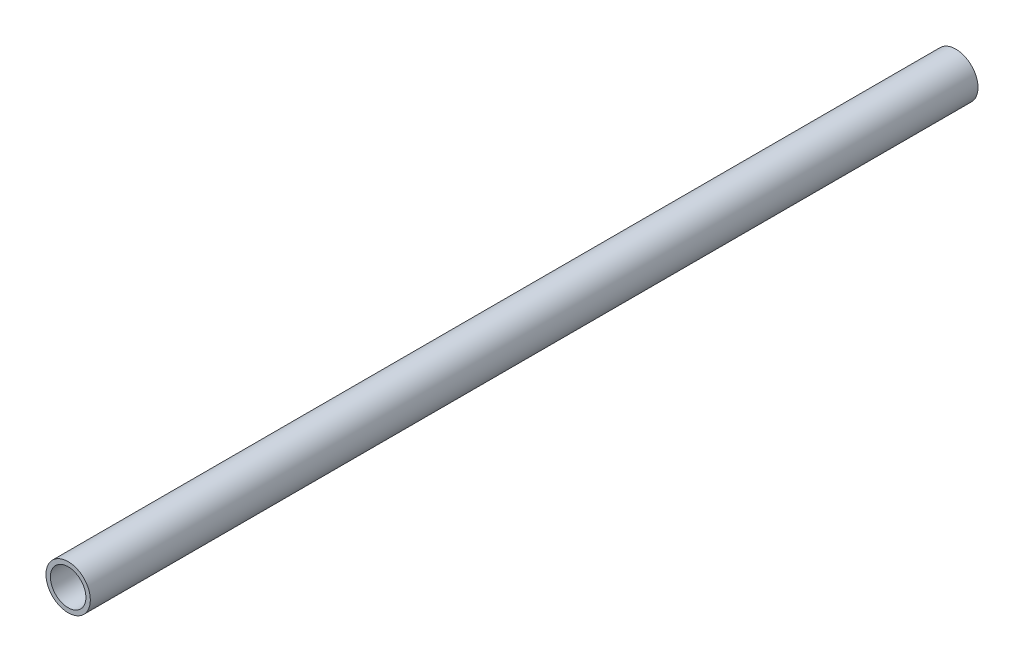
ISO-10303-21;
HEADER;
FILE_DESCRIPTION(('STEP AP214'),'2;1');
FILE_NAME('part.step','',(''),(''),'','','');
FILE_SCHEMA(('AUTOMOTIVE_DESIGN { 1 0 10303 214 1 1 1 1 }'));
ENDSEC;
DATA;
#1=APPLICATION_CONTEXT('core data for automotive mechanical design processes');
#2=APPLICATION_PROTOCOL_DEFINITION('international standard','automotive_design',2000,#1);
#3=PRODUCT_CONTEXT('',#1,'mechanical');
#4=PRODUCT('Part','Part','',(#3));
#5=PRODUCT_RELATED_PRODUCT_CATEGORY('part','',(#4));
#6=PRODUCT_DEFINITION_FORMATION('','',#4);
#7=PRODUCT_DEFINITION_CONTEXT('part definition',#1,'design');
#8=PRODUCT_DEFINITION('design','',#6,#7);
#9=PRODUCT_DEFINITION_SHAPE('','',#8);
#10=(LENGTH_UNIT() NAMED_UNIT(*) SI_UNIT(.MILLI.,.METRE.));
#11=(NAMED_UNIT(*) PLANE_ANGLE_UNIT() SI_UNIT($,.RADIAN.));
#12=(NAMED_UNIT(*) SI_UNIT($,.STERADIAN.) SOLID_ANGLE_UNIT());
#13=UNCERTAINTY_MEASURE_WITH_UNIT(LENGTH_MEASURE(1.E-05),#10,'distance_accuracy_value','');
#14=(GEOMETRIC_REPRESENTATION_CONTEXT(3) GLOBAL_UNCERTAINTY_ASSIGNED_CONTEXT((#13)) GLOBAL_UNIT_ASSIGNED_CONTEXT((#10,
#11,#12)) REPRESENTATION_CONTEXT('',''));
#15=CARTESIAN_POINT('',(0.,0.,0.));
#16=DIRECTION('',(0.,0.,1.));
#17=DIRECTION('',(1.,0.,0.));
#18=AXIS2_PLACEMENT_3D('',#15,#16,#17);
#19=CARTESIAN_POINT('',(0.,0.,200.));
#20=DIRECTION('',(0.,0.,1.));
#21=DIRECTION('',(1.,0.,0.));
#22=AXIS2_PLACEMENT_3D('',#19,#20,#21);
#23=PLANE('',#22);
#24=CARTESIAN_POINT('',(0.,0.,200.));
#25=DIRECTION('',(0.,0.,1.));
#26=DIRECTION('',(1.,0.,0.));
#27=AXIS2_PLACEMENT_3D('',#24,#25,#26);
#28=CIRCLE('',#27,5.);
#29=CARTESIAN_POINT('',(5.,0.,200.));
#30=VERTEX_POINT('',#29);
#31=EDGE_CURVE('E10',#30,#30,#28,.T.);
#32=ORIENTED_EDGE('',*,*,#31,.T.);
#33=EDGE_LOOP('',(#32));
#34=FACE_BOUND('',#33,.T.);
#35=CARTESIAN_POINT('',(0.,0.,200.));
#36=DIRECTION('',(0.,0.,1.));
#37=DIRECTION('',(1.,0.,0.));
#38=AXIS2_PLACEMENT_3D('',#35,#36,#37);
#39=CIRCLE('',#38,4.);
#40=CARTESIAN_POINT('',(4.,0.,200.));
#41=VERTEX_POINT('',#40);
#42=EDGE_CURVE('E42',#41,#41,#39,.T.);
#43=ORIENTED_EDGE('',*,*,#42,.F.);
#44=EDGE_LOOP('',(#43));
#45=FACE_BOUND('',#44,.T.);
#46=ADVANCED_FACE('F31',(#34,#45),#23,.T.);
#47=CARTESIAN_POINT('',(0.,0.,0.));
#48=DIRECTION('',(0.,0.,1.));
#49=DIRECTION('',(1.,0.,0.));
#50=AXIS2_PLACEMENT_3D('',#47,#48,#49);
#51=PLANE('',#50);
#52=CARTESIAN_POINT('',(0.,0.,0.));
#53=DIRECTION('',(0.,0.,1.));
#54=DIRECTION('',(1.,0.,0.));
#55=AXIS2_PLACEMENT_3D('',#52,#53,#54);
#56=CIRCLE('',#55,5.);
#57=CARTESIAN_POINT('',(5.,0.,0.));
#58=VERTEX_POINT('',#57);
#59=EDGE_CURVE('E35',#58,#58,#56,.T.);
#60=ORIENTED_EDGE('',*,*,#59,.F.);
#61=EDGE_LOOP('',(#60));
#62=FACE_BOUND('',#61,.T.);
#63=CARTESIAN_POINT('',(0.,0.,0.));
#64=DIRECTION('',(0.,0.,1.));
#65=DIRECTION('',(1.,0.,0.));
#66=AXIS2_PLACEMENT_3D('',#63,#64,#65);
#67=CIRCLE('',#66,4.);
#68=CARTESIAN_POINT('',(4.,0.,0.));
#69=VERTEX_POINT('',#68);
#70=EDGE_CURVE('E44',#69,#69,#67,.T.);
#71=ORIENTED_EDGE('',*,*,#70,.T.);
#72=EDGE_LOOP('',(#71));
#73=FACE_BOUND('',#72,.T.);
#74=ADVANCED_FACE('F54',(#62,#73),#51,.F.);
#75=CARTESIAN_POINT('',(0.,0.,200.));
#76=DIRECTION('',(0.,0.,-1.));
#77=DIRECTION('',(-1.,0.,0.));
#78=AXIS2_PLACEMENT_3D('',#75,#76,#77);
#79=CYLINDRICAL_SURFACE('',#78,5.);
#80=ORIENTED_EDGE('',*,*,#31,.F.);
#81=EDGE_LOOP('',(#80));
#82=FACE_BOUND('',#81,.T.);
#83=ORIENTED_EDGE('',*,*,#59,.T.);
#84=EDGE_LOOP('',(#83));
#85=FACE_BOUND('',#84,.T.);
#86=ADVANCED_FACE('F33',(#82,#85),#79,.T.);
#87=CARTESIAN_POINT('',(0.,0.,200.));
#88=DIRECTION('',(0.,0.,-1.));
#89=DIRECTION('',(-1.,0.,0.));
#90=AXIS2_PLACEMENT_3D('',#87,#88,#89);
#91=CYLINDRICAL_SURFACE('',#90,4.);
#92=ORIENTED_EDGE('',*,*,#42,.T.);
#93=EDGE_LOOP('',(#92));
#94=FACE_BOUND('',#93,.T.);
#95=ORIENTED_EDGE('',*,*,#70,.F.);
#96=EDGE_LOOP('',(#95));
#97=FACE_BOUND('',#96,.T.);
#98=ADVANCED_FACE('F50',(#94,#97),#91,.F.);
#99=CLOSED_SHELL('',(#46,#74,#86,#98));
#100=MANIFOLD_SOLID_BREP('B2',#99);
#101=ADVANCED_BREP_SHAPE_REPRESENTATION('',(#18,#100),#14);
#102=SHAPE_DEFINITION_REPRESENTATION(#9,#101);
ENDSEC;
END-ISO-10303-21;
